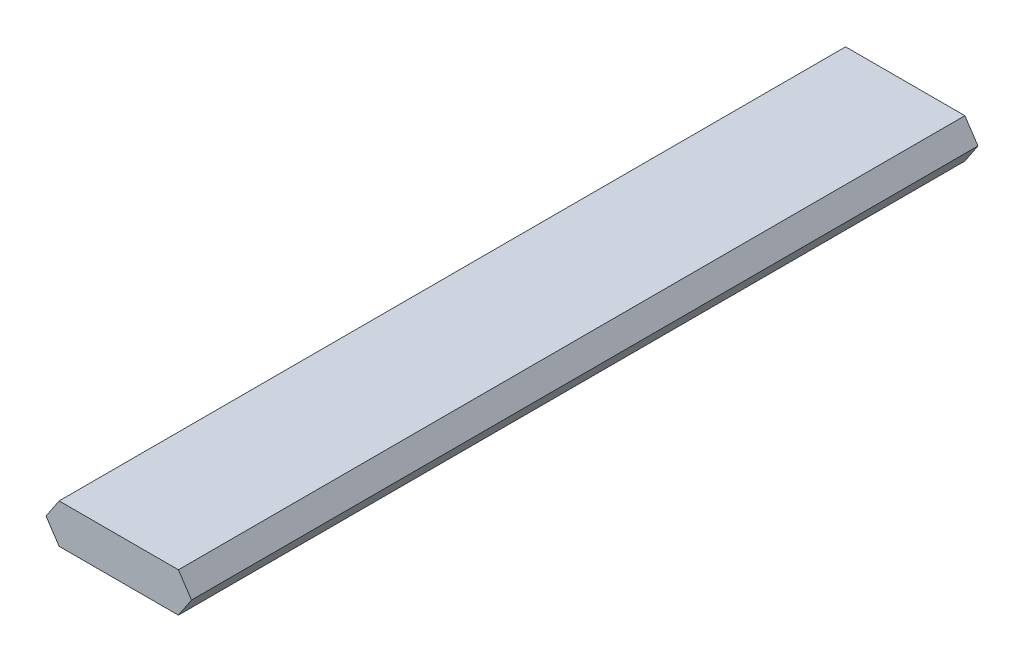
ISO-10303-21;
HEADER;
FILE_DESCRIPTION(('STEP AP214'),'2;1');
FILE_NAME('part.step','',(''),(''),'','','');
FILE_SCHEMA(('AUTOMOTIVE_DESIGN { 1 0 10303 214 1 1 1 1 }'));
ENDSEC;
DATA;
#1=APPLICATION_CONTEXT('core data for automotive mechanical design processes');
#2=APPLICATION_PROTOCOL_DEFINITION('international standard','automotive_design',2000,#1);
#3=PRODUCT_CONTEXT('',#1,'mechanical');
#4=PRODUCT('Part','Part','',(#3));
#5=PRODUCT_RELATED_PRODUCT_CATEGORY('part','',(#4));
#6=PRODUCT_DEFINITION_FORMATION('','',#4);
#7=PRODUCT_DEFINITION_CONTEXT('part definition',#1,'design');
#8=PRODUCT_DEFINITION('design','',#6,#7);
#9=PRODUCT_DEFINITION_SHAPE('','',#8);
#10=(LENGTH_UNIT() NAMED_UNIT(*) SI_UNIT(.MILLI.,.METRE.));
#11=(NAMED_UNIT(*) PLANE_ANGLE_UNIT() SI_UNIT($,.RADIAN.));
#12=(NAMED_UNIT(*) SI_UNIT($,.STERADIAN.) SOLID_ANGLE_UNIT());
#13=UNCERTAINTY_MEASURE_WITH_UNIT(LENGTH_MEASURE(1.E-05),#10,'distance_accuracy_value','');
#14=(GEOMETRIC_REPRESENTATION_CONTEXT(3) GLOBAL_UNCERTAINTY_ASSIGNED_CONTEXT((#13)) GLOBAL_UNIT_ASSIGNED_CONTEXT((#10,
#11,#12)) REPRESENTATION_CONTEXT('',''));
#15=CARTESIAN_POINT('',(0.,0.,0.));
#16=DIRECTION('',(0.,0.,1.));
#17=DIRECTION('',(1.,0.,0.));
#18=AXIS2_PLACEMENT_3D('',#15,#16,#17);
#19=CARTESIAN_POINT('',(0.,0.,120.));
#20=DIRECTION('',(0.832050294337844,0.554700196225229,0.));
#21=DIRECTION('',(-0.554700196225229,0.832050294337844,0.));
#22=AXIS2_PLACEMENT_3D('',#19,#20,#21);
#23=PLANE('',#22);
#24=DIRECTION('',(0.554700196225229,-0.832050294337844,0.));
#25=VECTOR('',#24,1.);
#26=CARTESIAN_POINT('',(0.,0.,0.));
#27=LINE('',#26,#25);
#28=CARTESIAN_POINT('',(0.,0.,0.));
#29=VERTEX_POINT('',#28);
#30=CARTESIAN_POINT('',(2.,-3.,0.));
#31=VERTEX_POINT('',#30);
#32=EDGE_CURVE('E124',#29,#31,#27,.T.);
#33=ORIENTED_EDGE('',*,*,#32,.T.);
#34=DIRECTION('',(0.,0.,-1.));
#35=VECTOR('',#34,1.);
#36=CARTESIAN_POINT('',(2.,-3.,120.));
#37=LINE('',#36,#35);
#38=CARTESIAN_POINT('',(2.,-3.,120.));
#39=VERTEX_POINT('',#38);
#40=EDGE_CURVE('E11',#39,#31,#37,.T.);
#41=ORIENTED_EDGE('',*,*,#40,.F.);
#42=DIRECTION('',(0.554700196225229,-0.832050294337844,0.));
#43=VECTOR('',#42,1.);
#44=CARTESIAN_POINT('',(0.,0.,120.));
#45=LINE('',#44,#43);
#46=CARTESIAN_POINT('',(0.,0.,120.));
#47=VERTEX_POINT('',#46);
#48=EDGE_CURVE('E134',#47,#39,#45,.T.);
#49=ORIENTED_EDGE('',*,*,#48,.F.);
#50=DIRECTION('',(0.,0.,-1.));
#51=VECTOR('',#50,1.);
#52=CARTESIAN_POINT('',(0.,0.,120.));
#53=LINE('',#52,#51);
#54=EDGE_CURVE('E120',#47,#29,#53,.T.);
#55=ORIENTED_EDGE('',*,*,#54,.T.);
#56=EDGE_LOOP('',(#33,#41,#49,#55));
#57=FACE_BOUND('',#56,.T.);
#58=ADVANCED_FACE('F37',(#57),#23,.F.);
#59=CARTESIAN_POINT('',(2.,-3.,120.));
#60=DIRECTION('',(0.,1.,0.));
#61=DIRECTION('',(0.,0.,1.));
#62=AXIS2_PLACEMENT_3D('',#59,#60,#61);
#63=PLANE('',#62);
#64=DIRECTION('',(1.,0.,0.));
#65=VECTOR('',#64,1.);
#66=CARTESIAN_POINT('',(2.,-3.,0.));
#67=LINE('',#66,#65);
#68=CARTESIAN_POINT('',(20.2,-3.,0.));
#69=VERTEX_POINT('',#68);
#70=EDGE_CURVE('E127',#31,#69,#67,.T.);
#71=ORIENTED_EDGE('',*,*,#70,.T.);
#72=DIRECTION('',(0.,0.,-1.));
#73=VECTOR('',#72,1.);
#74=CARTESIAN_POINT('',(20.2,-3.,120.));
#75=LINE('',#74,#73);
#76=CARTESIAN_POINT('',(20.2,-3.,120.));
#77=VERTEX_POINT('',#76);
#78=EDGE_CURVE('E45',#77,#69,#75,.T.);
#79=ORIENTED_EDGE('',*,*,#78,.F.);
#80=DIRECTION('',(1.,0.,0.));
#81=VECTOR('',#80,1.);
#82=CARTESIAN_POINT('',(2.,-3.,120.));
#83=LINE('',#82,#81);
#84=EDGE_CURVE('E90',#39,#77,#83,.T.);
#85=ORIENTED_EDGE('',*,*,#84,.F.);
#86=ORIENTED_EDGE('',*,*,#40,.T.);
#87=EDGE_LOOP('',(#71,#79,#85,#86));
#88=FACE_BOUND('',#87,.T.);
#89=ADVANCED_FACE('F161',(#88),#63,.F.);
#90=CARTESIAN_POINT('',(22.2,0.,120.));
#91=DIRECTION('',(-0.832050294337844,0.554700196225229,0.));
#92=DIRECTION('',(-0.554700196225229,-0.832050294337844,0.));
#93=AXIS2_PLACEMENT_3D('',#90,#91,#92);
#94=PLANE('',#93);
#95=DIRECTION('',(0.554700196225229,0.832050294337844,0.));
#96=VECTOR('',#95,1.);
#97=CARTESIAN_POINT('',(22.2,0.,0.));
#98=LINE('',#97,#96);
#99=CARTESIAN_POINT('',(22.2,0.,0.));
#100=VERTEX_POINT('',#99);
#101=EDGE_CURVE('E129',#69,#100,#98,.T.);
#102=ORIENTED_EDGE('',*,*,#101,.T.);
#103=DIRECTION('',(0.,0.,-1.));
#104=VECTOR('',#103,1.);
#105=CARTESIAN_POINT('',(22.2,0.,120.));
#106=LINE('',#105,#104);
#107=CARTESIAN_POINT('',(22.2,0.,120.));
#108=VERTEX_POINT('',#107);
#109=EDGE_CURVE('E113',#108,#100,#106,.T.);
#110=ORIENTED_EDGE('',*,*,#109,.F.);
#111=DIRECTION('',(0.554700196225229,0.832050294337844,0.));
#112=VECTOR('',#111,1.);
#113=CARTESIAN_POINT('',(22.2,0.,120.));
#114=LINE('',#113,#112);
#115=EDGE_CURVE('E103',#77,#108,#114,.T.);
#116=ORIENTED_EDGE('',*,*,#115,.F.);
#117=ORIENTED_EDGE('',*,*,#78,.T.);
#118=EDGE_LOOP('',(#102,#110,#116,#117));
#119=FACE_BOUND('',#118,.T.);
#120=ADVANCED_FACE('F143',(#119),#94,.F.);
#121=CARTESIAN_POINT('',(22.2,0.,120.));
#122=DIRECTION('',(-0.832050294337844,-0.554700196225229,0.));
#123=DIRECTION('',(0.554700196225229,-0.832050294337844,0.));
#124=AXIS2_PLACEMENT_3D('',#121,#122,#123);
#125=PLANE('',#124);
#126=DIRECTION('',(-0.554700196225229,0.832050294337844,0.));
#127=VECTOR('',#126,1.);
#128=CARTESIAN_POINT('',(22.2,0.,0.));
#129=LINE('',#128,#127);
#130=CARTESIAN_POINT('',(20.2,3.,0.));
#131=VERTEX_POINT('',#130);
#132=EDGE_CURVE('E111',#100,#131,#129,.T.);
#133=ORIENTED_EDGE('',*,*,#132,.T.);
#134=DIRECTION('',(0.,0.,-1.));
#135=VECTOR('',#134,1.);
#136=CARTESIAN_POINT('',(20.2,3.,120.));
#137=LINE('',#136,#135);
#138=CARTESIAN_POINT('',(20.2,3.,120.));
#139=VERTEX_POINT('',#138);
#140=EDGE_CURVE('E108',#139,#131,#137,.T.);
#141=ORIENTED_EDGE('',*,*,#140,.F.);
#142=DIRECTION('',(-0.554700196225229,0.832050294337844,0.));
#143=VECTOR('',#142,1.);
#144=CARTESIAN_POINT('',(22.2,0.,120.));
#145=LINE('',#144,#143);
#146=EDGE_CURVE('E97',#108,#139,#145,.T.);
#147=ORIENTED_EDGE('',*,*,#146,.F.);
#148=ORIENTED_EDGE('',*,*,#109,.T.);
#149=EDGE_LOOP('',(#133,#141,#147,#148));
#150=FACE_BOUND('',#149,.T.);
#151=ADVANCED_FACE('F109',(#150),#125,.F.);
#152=CARTESIAN_POINT('',(2.,3.,120.));
#153=DIRECTION('',(0.,-1.,0.));
#154=DIRECTION('',(0.,0.,-1.));
#155=AXIS2_PLACEMENT_3D('',#152,#153,#154);
#156=PLANE('',#155);
#157=DIRECTION('',(-1.,0.,0.));
#158=VECTOR('',#157,1.);
#159=CARTESIAN_POINT('',(2.,3.,0.));
#160=LINE('',#159,#158);
#161=CARTESIAN_POINT('',(2.,3.,0.));
#162=VERTEX_POINT('',#161);
#163=EDGE_CURVE('E76',#131,#162,#160,.T.);
#164=ORIENTED_EDGE('',*,*,#163,.T.);
#165=DIRECTION('',(0.,0.,-1.));
#166=VECTOR('',#165,1.);
#167=CARTESIAN_POINT('',(2.,3.,120.));
#168=LINE('',#167,#166);
#169=CARTESIAN_POINT('',(2.,3.,120.));
#170=VERTEX_POINT('',#169);
#171=EDGE_CURVE('E114',#170,#162,#168,.T.);
#172=ORIENTED_EDGE('',*,*,#171,.F.);
#173=DIRECTION('',(-1.,0.,0.));
#174=VECTOR('',#173,1.);
#175=CARTESIAN_POINT('',(2.,3.,120.));
#176=LINE('',#175,#174);
#177=EDGE_CURVE('E101',#139,#170,#176,.T.);
#178=ORIENTED_EDGE('',*,*,#177,.F.);
#179=ORIENTED_EDGE('',*,*,#140,.T.);
#180=EDGE_LOOP('',(#164,#172,#178,#179));
#181=FACE_BOUND('',#180,.T.);
#182=ADVANCED_FACE('F116',(#181),#156,.F.);
#183=CARTESIAN_POINT('',(0.,0.,120.));
#184=DIRECTION('',(0.832050294337844,-0.554700196225229,0.));
#185=DIRECTION('',(0.554700196225229,0.832050294337844,0.));
#186=AXIS2_PLACEMENT_3D('',#183,#184,#185);
#187=PLANE('',#186);
#188=DIRECTION('',(-0.554700196225229,-0.832050294337844,0.));
#189=VECTOR('',#188,1.);
#190=CARTESIAN_POINT('',(0.,0.,0.));
#191=LINE('',#190,#189);
#192=EDGE_CURVE('E82',#162,#29,#191,.T.);
#193=ORIENTED_EDGE('',*,*,#192,.T.);
#194=ORIENTED_EDGE('',*,*,#54,.F.);
#195=DIRECTION('',(-0.554700196225229,-0.832050294337844,0.));
#196=VECTOR('',#195,1.);
#197=CARTESIAN_POINT('',(0.,0.,120.));
#198=LINE('',#197,#196);
#199=EDGE_CURVE('E53',#170,#47,#198,.T.);
#200=ORIENTED_EDGE('',*,*,#199,.F.);
#201=ORIENTED_EDGE('',*,*,#171,.T.);
#202=EDGE_LOOP('',(#193,#194,#200,#201));
#203=FACE_BOUND('',#202,.T.);
#204=ADVANCED_FACE('F150',(#203),#187,.F.);
#205=CARTESIAN_POINT('',(0.,0.,120.));
#206=DIRECTION('',(0.,0.,-1.));
#207=DIRECTION('',(-1.,0.,0.));
#208=AXIS2_PLACEMENT_3D('',#205,#206,#207);
#209=PLANE('',#208);
#210=ORIENTED_EDGE('',*,*,#48,.T.);
#211=ORIENTED_EDGE('',*,*,#84,.T.);
#212=ORIENTED_EDGE('',*,*,#115,.T.);
#213=ORIENTED_EDGE('',*,*,#146,.T.);
#214=ORIENTED_EDGE('',*,*,#177,.T.);
#215=ORIENTED_EDGE('',*,*,#199,.T.);
#216=EDGE_LOOP('',(#210,#211,#212,#213,#214,#215));
#217=FACE_BOUND('',#216,.T.);
#218=ADVANCED_FACE('F99',(#217),#209,.F.);
#219=CARTESIAN_POINT('',(0.,0.,0.));
#220=DIRECTION('',(0.,0.,-1.));
#221=DIRECTION('',(-1.,0.,0.));
#222=AXIS2_PLACEMENT_3D('',#219,#220,#221);
#223=PLANE('',#222);
#224=ORIENTED_EDGE('',*,*,#32,.F.);
#225=ORIENTED_EDGE('',*,*,#192,.F.);
#226=ORIENTED_EDGE('',*,*,#163,.F.);
#227=ORIENTED_EDGE('',*,*,#132,.F.);
#228=ORIENTED_EDGE('',*,*,#101,.F.);
#229=ORIENTED_EDGE('',*,*,#70,.F.);
#230=EDGE_LOOP('',(#224,#225,#226,#227,#228,#229));
#231=FACE_BOUND('',#230,.T.);
#232=ADVANCED_FACE('F146',(#231),#223,.T.);
#233=CLOSED_SHELL('',(#58,#89,#120,#151,#182,#204,#218,#232));
#234=MANIFOLD_SOLID_BREP('B2',#233);
#235=ADVANCED_BREP_SHAPE_REPRESENTATION('',(#18,#234),#14);
#236=SHAPE_DEFINITION_REPRESENTATION(#9,#235);
ENDSEC;
END-ISO-10303-21;
